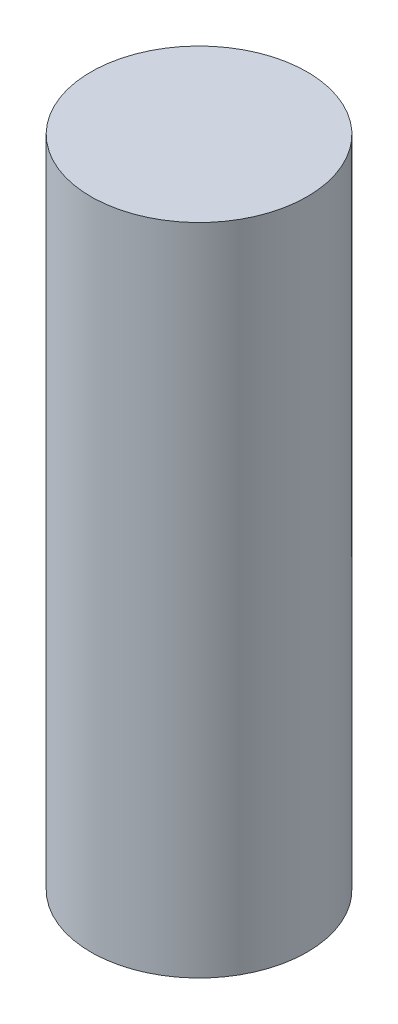
ISO-10303-21;
HEADER;
FILE_DESCRIPTION(('STEP AP214'),'2;1');
FILE_NAME('part.step','',(''),(''),'','','');
FILE_SCHEMA(('AUTOMOTIVE_DESIGN { 1 0 10303 214 1 1 1 1 }'));
ENDSEC;
DATA;
#1=APPLICATION_CONTEXT('core data for automotive mechanical design processes');
#2=APPLICATION_PROTOCOL_DEFINITION('international standard','automotive_design',2000,#1);
#3=PRODUCT_CONTEXT('',#1,'mechanical');
#4=PRODUCT('Part','Part','',(#3));
#5=PRODUCT_RELATED_PRODUCT_CATEGORY('part','',(#4));
#6=PRODUCT_DEFINITION_FORMATION('','',#4);
#7=PRODUCT_DEFINITION_CONTEXT('part definition',#1,'design');
#8=PRODUCT_DEFINITION('design','',#6,#7);
#9=PRODUCT_DEFINITION_SHAPE('','',#8);
#10=(LENGTH_UNIT() NAMED_UNIT(*) SI_UNIT(.MILLI.,.METRE.));
#11=(NAMED_UNIT(*) PLANE_ANGLE_UNIT() SI_UNIT($,.RADIAN.));
#12=(NAMED_UNIT(*) SI_UNIT($,.STERADIAN.) SOLID_ANGLE_UNIT());
#13=UNCERTAINTY_MEASURE_WITH_UNIT(LENGTH_MEASURE(1.E-05),#10,'distance_accuracy_value','');
#14=(GEOMETRIC_REPRESENTATION_CONTEXT(3) GLOBAL_UNCERTAINTY_ASSIGNED_CONTEXT((#13)) GLOBAL_UNIT_ASSIGNED_CONTEXT((#10,
#11,#12)) REPRESENTATION_CONTEXT('',''));
#15=CARTESIAN_POINT('',(0.,0.,0.));
#16=DIRECTION('',(0.,0.,1.));
#17=DIRECTION('',(1.,0.,0.));
#18=AXIS2_PLACEMENT_3D('',#15,#16,#17);
#19=CARTESIAN_POINT('',(0.,19.214,0.));
#20=DIRECTION('',(0.,-1.,0.));
#21=DIRECTION('',(0.,0.,1.));
#22=AXIS2_PLACEMENT_3D('',#19,#20,#21);
#23=CYLINDRICAL_SURFACE('',#22,3.175);
#24=CARTESIAN_POINT('',(0.,19.214,0.));
#25=DIRECTION('',(0.,-1.,0.));
#26=DIRECTION('',(1.,0.,0.));
#27=AXIS2_PLACEMENT_3D('',#24,#25,#26);
#28=CIRCLE('',#27,3.175);
#29=CARTESIAN_POINT('',(3.175,19.214,0.));
#30=VERTEX_POINT('',#29);
#31=EDGE_CURVE('E38',#30,#30,#28,.T.);
#32=ORIENTED_EDGE('',*,*,#31,.T.);
#33=EDGE_LOOP('',(#32));
#34=FACE_BOUND('',#33,.T.);
#35=CARTESIAN_POINT('',(0.,0.,0.));
#36=DIRECTION('',(0.,-1.,0.));
#37=DIRECTION('',(1.,0.,0.));
#38=AXIS2_PLACEMENT_3D('',#35,#36,#37);
#39=CIRCLE('',#38,3.175);
#40=CARTESIAN_POINT('',(3.175,0.,0.));
#41=VERTEX_POINT('',#40);
#42=EDGE_CURVE('E10',#41,#41,#39,.T.);
#43=ORIENTED_EDGE('',*,*,#42,.F.);
#44=EDGE_LOOP('',(#43));
#45=FACE_BOUND('',#44,.T.);
#46=ADVANCED_FACE('F32',(#34,#45),#23,.T.);
#47=CARTESIAN_POINT('',(0.,19.214,0.));
#48=DIRECTION('',(0.,1.,0.));
#49=DIRECTION('',(0.,0.,-1.));
#50=AXIS2_PLACEMENT_3D('',#47,#48,#49);
#51=PLANE('',#50);
#52=ORIENTED_EDGE('',*,*,#31,.F.);
#53=EDGE_LOOP('',(#52));
#54=FACE_BOUND('',#53,.T.);
#55=ADVANCED_FACE('F46',(#54),#51,.T.);
#56=CARTESIAN_POINT('',(0.,0.,0.));
#57=DIRECTION('',(0.,1.,0.));
#58=DIRECTION('',(0.,0.,-1.));
#59=AXIS2_PLACEMENT_3D('',#56,#57,#58);
#60=PLANE('',#59);
#61=ORIENTED_EDGE('',*,*,#42,.T.);
#62=EDGE_LOOP('',(#61));
#63=FACE_BOUND('',#62,.T.);
#64=ADVANCED_FACE('F48',(#63),#60,.F.);
#65=CLOSED_SHELL('',(#46,#55,#64));
#66=MANIFOLD_SOLID_BREP('B2',#65);
#67=ADVANCED_BREP_SHAPE_REPRESENTATION('',(#18,#66),#14);
#68=SHAPE_DEFINITION_REPRESENTATION(#9,#67);
ENDSEC;
END-ISO-10303-21;
